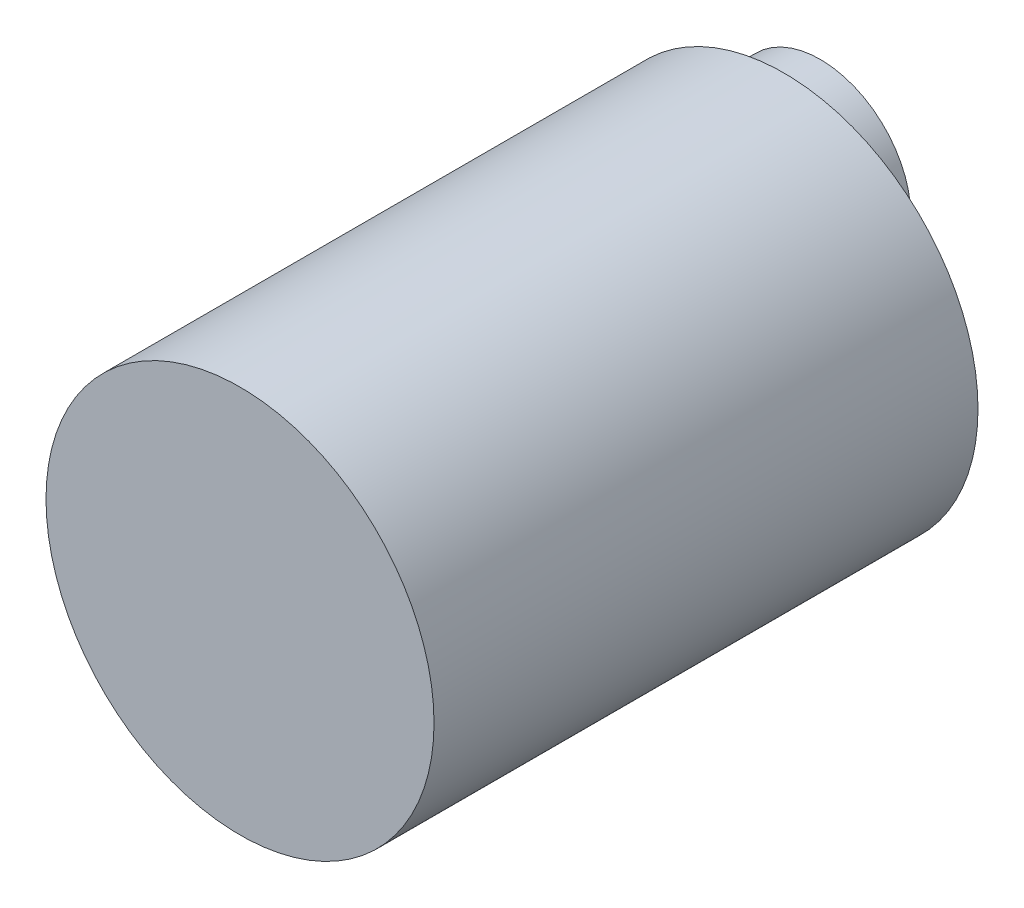
ISO-10303-21;
HEADER;
FILE_DESCRIPTION(('STEP AP214'),'2;1');
FILE_NAME('part.step','',(''),(''),'','','');
FILE_SCHEMA(('AUTOMOTIVE_DESIGN { 1 0 10303 214 1 1 1 1 }'));
ENDSEC;
DATA;
#1=APPLICATION_CONTEXT('core data for automotive mechanical design processes');
#2=APPLICATION_PROTOCOL_DEFINITION('international standard','automotive_design',2000,#1);
#3=PRODUCT_CONTEXT('',#1,'mechanical');
#4=PRODUCT('Part','Part','',(#3));
#5=PRODUCT_RELATED_PRODUCT_CATEGORY('part','',(#4));
#6=PRODUCT_DEFINITION_FORMATION('','',#4);
#7=PRODUCT_DEFINITION_CONTEXT('part definition',#1,'design');
#8=PRODUCT_DEFINITION('design','',#6,#7);
#9=PRODUCT_DEFINITION_SHAPE('','',#8);
#10=(LENGTH_UNIT() NAMED_UNIT(*) SI_UNIT(.MILLI.,.METRE.));
#11=(NAMED_UNIT(*) PLANE_ANGLE_UNIT() SI_UNIT($,.RADIAN.));
#12=(NAMED_UNIT(*) SI_UNIT($,.STERADIAN.) SOLID_ANGLE_UNIT());
#13=UNCERTAINTY_MEASURE_WITH_UNIT(LENGTH_MEASURE(1.E-05),#10,'distance_accuracy_value','');
#14=(GEOMETRIC_REPRESENTATION_CONTEXT(3) GLOBAL_UNCERTAINTY_ASSIGNED_CONTEXT((#13)) GLOBAL_UNIT_ASSIGNED_CONTEXT((#10,
#11,#12)) REPRESENTATION_CONTEXT('',''));
#15=CARTESIAN_POINT('',(0.,0.,0.));
#16=DIRECTION('',(0.,0.,1.));
#17=DIRECTION('',(1.,0.,0.));
#18=AXIS2_PLACEMENT_3D('',#15,#16,#17);
#19=CARTESIAN_POINT('',(0.,0.,38.1));
#20=DIRECTION('',(0.,0.,-1.));
#21=DIRECTION('',(-1.,0.,0.));
#22=AXIS2_PLACEMENT_3D('',#19,#20,#21);
#23=CYLINDRICAL_SURFACE('',#22,13.589);
#24=CARTESIAN_POINT('',(0.,0.,38.1));
#25=DIRECTION('',(0.,0.,1.));
#26=DIRECTION('',(1.,0.,0.));
#27=AXIS2_PLACEMENT_3D('',#24,#25,#26);
#28=CIRCLE('',#27,13.589);
#29=CARTESIAN_POINT('',(13.589,0.,38.1));
#30=VERTEX_POINT('',#29);
#31=EDGE_CURVE('E10',#30,#30,#28,.T.);
#32=ORIENTED_EDGE('',*,*,#31,.F.);
#33=EDGE_LOOP('',(#32));
#34=FACE_BOUND('',#33,.T.);
#35=CARTESIAN_POINT('',(0.,0.,0.));
#36=DIRECTION('',(0.,0.,1.));
#37=DIRECTION('',(1.,0.,0.));
#38=AXIS2_PLACEMENT_3D('',#35,#36,#37);
#39=CIRCLE('',#38,13.589);
#40=CARTESIAN_POINT('',(13.589,0.,0.));
#41=VERTEX_POINT('',#40);
#42=EDGE_CURVE('E34',#41,#41,#39,.T.);
#43=ORIENTED_EDGE('',*,*,#42,.T.);
#44=EDGE_LOOP('',(#43));
#45=FACE_BOUND('',#44,.T.);
#46=ADVANCED_FACE('F31',(#34,#45),#23,.T.);
#47=CARTESIAN_POINT('',(0.,0.,38.1));
#48=DIRECTION('',(0.,0.,1.));
#49=DIRECTION('',(1.,0.,0.));
#50=AXIS2_PLACEMENT_3D('',#47,#48,#49);
#51=PLANE('',#50);
#52=ORIENTED_EDGE('',*,*,#31,.T.);
#53=EDGE_LOOP('',(#52));
#54=FACE_BOUND('',#53,.T.);
#55=ADVANCED_FACE('F61',(#54),#51,.T.);
#56=CARTESIAN_POINT('',(0.,0.,0.));
#57=DIRECTION('',(0.,0.,1.));
#58=DIRECTION('',(1.,0.,0.));
#59=AXIS2_PLACEMENT_3D('',#56,#57,#58);
#60=PLANE('',#59);
#61=CARTESIAN_POINT('',(0.,6.7945,0.));
#62=DIRECTION('',(0.,0.,1.));
#63=DIRECTION('',(1.,0.,0.));
#64=AXIS2_PLACEMENT_3D('',#61,#62,#63);
#65=CIRCLE('',#64,6.35);
#66=CARTESIAN_POINT('',(6.35,6.7945,0.));
#67=VERTEX_POINT('',#66);
#68=EDGE_CURVE('E43',#67,#67,#65,.T.);
#69=ORIENTED_EDGE('',*,*,#68,.T.);
#70=EDGE_LOOP('',(#69));
#71=FACE_BOUND('',#70,.T.);
#72=ORIENTED_EDGE('',*,*,#42,.F.);
#73=EDGE_LOOP('',(#72));
#74=FACE_BOUND('',#73,.T.);
#75=ADVANCED_FACE('F58',(#71,#74),#60,.F.);
#76=CARTESIAN_POINT('',(0.,6.7945,-2.54));
#77=DIRECTION('',(0.,0.,1.));
#78=DIRECTION('',(1.,0.,0.));
#79=AXIS2_PLACEMENT_3D('',#76,#77,#78);
#80=CYLINDRICAL_SURFACE('',#79,6.35);
#81=CARTESIAN_POINT('',(0.,6.7945,-2.54));
#82=DIRECTION('',(0.,0.,1.));
#83=DIRECTION('',(1.,0.,0.));
#84=AXIS2_PLACEMENT_3D('',#81,#82,#83);
#85=CIRCLE('',#84,6.35);
#86=CARTESIAN_POINT('',(6.35,6.7945,-2.54));
#87=VERTEX_POINT('',#86);
#88=EDGE_CURVE('E41',#87,#87,#85,.T.);
#89=ORIENTED_EDGE('',*,*,#88,.T.);
#90=EDGE_LOOP('',(#89));
#91=FACE_BOUND('',#90,.T.);
#92=ORIENTED_EDGE('',*,*,#68,.F.);
#93=EDGE_LOOP('',(#92));
#94=FACE_BOUND('',#93,.T.);
#95=ADVANCED_FACE('F49',(#91,#94),#80,.T.);
#96=CARTESIAN_POINT('',(0.,0.,-2.54));
#97=DIRECTION('',(0.,0.,1.));
#98=DIRECTION('',(1.,0.,0.));
#99=AXIS2_PLACEMENT_3D('',#96,#97,#98);
#100=PLANE('',#99);
#101=ORIENTED_EDGE('',*,*,#88,.F.);
#102=EDGE_LOOP('',(#101));
#103=FACE_BOUND('',#102,.T.);
#104=ADVANCED_FACE('F52',(#103),#100,.F.);
#105=CLOSED_SHELL('',(#46,#55,#75,#95,#104));
#106=MANIFOLD_SOLID_BREP('B2',#105);
#107=ADVANCED_BREP_SHAPE_REPRESENTATION('',(#18,#106),#14);
#108=SHAPE_DEFINITION_REPRESENTATION(#9,#107);
ENDSEC;
END-ISO-10303-21;
